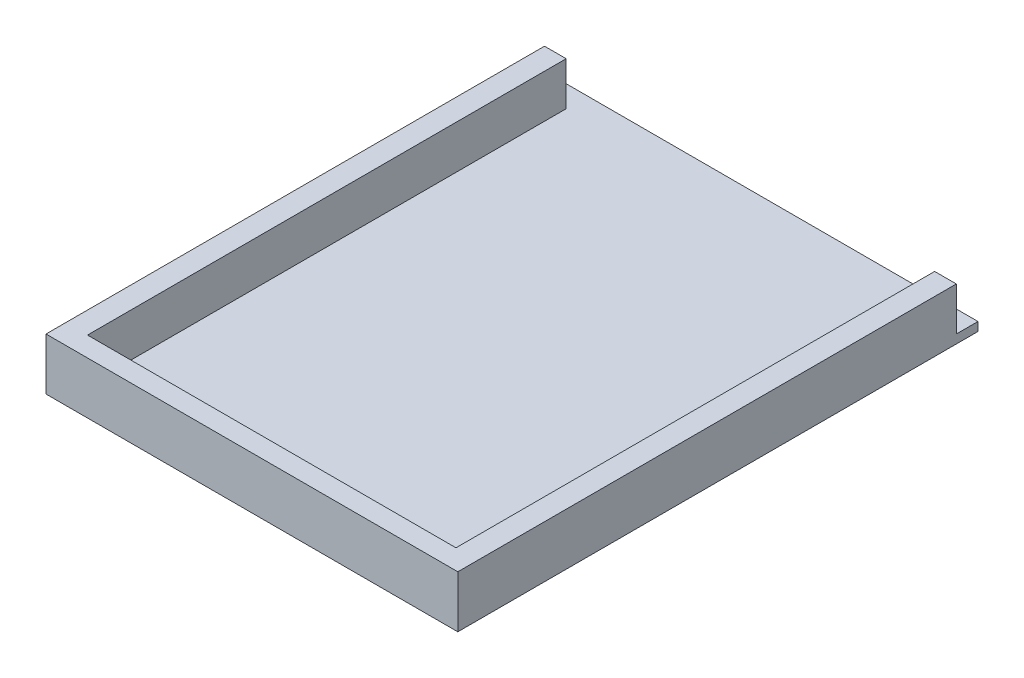
ISO-10303-21;
HEADER;
FILE_DESCRIPTION(('STEP AP214'),'2;1');
FILE_NAME('part.step','',(''),(''),'','','');
FILE_SCHEMA(('AUTOMOTIVE_DESIGN { 1 0 10303 214 1 1 1 1 }'));
ENDSEC;
DATA;
#1=APPLICATION_CONTEXT('core data for automotive mechanical design processes');
#2=APPLICATION_PROTOCOL_DEFINITION('international standard','automotive_design',2000,#1);
#3=PRODUCT_CONTEXT('',#1,'mechanical');
#4=PRODUCT('Part','Part','',(#3));
#5=PRODUCT_RELATED_PRODUCT_CATEGORY('part','',(#4));
#6=PRODUCT_DEFINITION_FORMATION('','',#4);
#7=PRODUCT_DEFINITION_CONTEXT('part definition',#1,'design');
#8=PRODUCT_DEFINITION('design','',#6,#7);
#9=PRODUCT_DEFINITION_SHAPE('','',#8);
#10=(LENGTH_UNIT() NAMED_UNIT(*) SI_UNIT(.MILLI.,.METRE.));
#11=(NAMED_UNIT(*) PLANE_ANGLE_UNIT() SI_UNIT($,.RADIAN.));
#12=(NAMED_UNIT(*) SI_UNIT($,.STERADIAN.) SOLID_ANGLE_UNIT());
#13=UNCERTAINTY_MEASURE_WITH_UNIT(LENGTH_MEASURE(1.E-05),#10,'distance_accuracy_value','');
#14=(GEOMETRIC_REPRESENTATION_CONTEXT(3) GLOBAL_UNCERTAINTY_ASSIGNED_CONTEXT((#13)) GLOBAL_UNIT_ASSIGNED_CONTEXT((#10,
#11,#12)) REPRESENTATION_CONTEXT('',''));
#15=CARTESIAN_POINT('',(0.,0.,0.));
#16=DIRECTION('',(0.,0.,1.));
#17=DIRECTION('',(1.,0.,0.));
#18=AXIS2_PLACEMENT_3D('',#15,#16,#17);
#19=CARTESIAN_POINT('',(0.,5.08,0.));
#20=DIRECTION('',(0.,1.,0.));
#21=DIRECTION('',(0.,0.,1.));
#22=AXIS2_PLACEMENT_3D('',#19,#20,#21);
#23=PLANE('',#22);
#24=DIRECTION('',(0.,0.,-1.));
#25=VECTOR('',#24,1.);
#26=CARTESIAN_POINT('',(107.95,5.08,0.));
#27=LINE('',#26,#25);
#28=CARTESIAN_POINT('',(107.95,5.08,140.783695346635));
#29=VERTEX_POINT('',#28);
#30=CARTESIAN_POINT('',(107.95,5.08,-139.7));
#31=VERTEX_POINT('',#30);
#32=EDGE_CURVE('E53',#29,#31,#27,.T.);
#33=ORIENTED_EDGE('',*,*,#32,.T.);
#34=DIRECTION('',(1.,0.,0.));
#35=VECTOR('',#34,1.);
#36=CARTESIAN_POINT('',(0.,5.08,-139.7));
#37=LINE('',#36,#35);
#38=CARTESIAN_POINT('',(120.65,5.08,-139.7));
#39=VERTEX_POINT('',#38);
#40=EDGE_CURVE('E39',#31,#39,#37,.T.);
#41=ORIENTED_EDGE('',*,*,#40,.T.);
#42=DIRECTION('',(0.,0.,-1.));
#43=VECTOR('',#42,1.);
#44=CARTESIAN_POINT('',(120.65,5.08,0.));
#45=LINE('',#44,#43);
#46=CARTESIAN_POINT('',(120.65,5.08,-152.4));
#47=VERTEX_POINT('',#46);
#48=EDGE_CURVE('E105',#39,#47,#45,.T.);
#49=ORIENTED_EDGE('',*,*,#48,.T.);
#50=DIRECTION('',(1.,0.,0.));
#51=VECTOR('',#50,1.);
#52=CARTESIAN_POINT('',(0.,5.08,-152.4));
#53=LINE('',#52,#51);
#54=CARTESIAN_POINT('',(-120.65,5.08,-152.4));
#55=VERTEX_POINT('',#54);
#56=EDGE_CURVE('E108',#55,#47,#53,.T.);
#57=ORIENTED_EDGE('',*,*,#56,.F.);
#58=DIRECTION('',(0.,0.,-1.));
#59=VECTOR('',#58,1.);
#60=CARTESIAN_POINT('',(-120.65,5.08,0.));
#61=LINE('',#60,#59);
#62=CARTESIAN_POINT('',(-120.65,5.08,-139.7));
#63=VERTEX_POINT('',#62);
#64=EDGE_CURVE('E62',#63,#55,#61,.T.);
#65=ORIENTED_EDGE('',*,*,#64,.F.);
#66=CARTESIAN_POINT('',(-107.95,5.08,-139.7));
#67=VERTEX_POINT('',#66);
#68=EDGE_CURVE('E207',#63,#67,#37,.T.);
#69=ORIENTED_EDGE('',*,*,#68,.T.);
#70=DIRECTION('',(0.,0.,1.));
#71=VECTOR('',#70,1.);
#72=CARTESIAN_POINT('',(-107.95,5.08,0.));
#73=LINE('',#72,#71);
#74=CARTESIAN_POINT('',(-107.95,5.08,140.783695346635));
#75=VERTEX_POINT('',#74);
#76=EDGE_CURVE('E205',#67,#75,#73,.T.);
#77=ORIENTED_EDGE('',*,*,#76,.T.);
#78=DIRECTION('',(1.,0.,0.));
#79=VECTOR('',#78,1.);
#80=CARTESIAN_POINT('',(0.,5.08,140.783695346635));
#81=LINE('',#80,#79);
#82=EDGE_CURVE('E203',#75,#29,#81,.T.);
#83=ORIENTED_EDGE('',*,*,#82,.T.);
#84=EDGE_LOOP('',(#33,#41,#49,#57,#65,#69,#77,#83));
#85=FACE_BOUND('',#84,.T.);
#86=ADVANCED_FACE('F35',(#85),#23,.T.);
#87=CARTESIAN_POINT('',(0.,5.08,152.4));
#88=DIRECTION('',(0.,0.,-1.));
#89=DIRECTION('',(-1.,0.,0.));
#90=AXIS2_PLACEMENT_3D('',#87,#88,#89);
#91=PLANE('',#90);
#92=DIRECTION('',(1.,0.,0.));
#93=VECTOR('',#92,1.);
#94=CARTESIAN_POINT('',(0.,0.,152.4));
#95=LINE('',#94,#93);
#96=CARTESIAN_POINT('',(-120.65,0.,152.4));
#97=VERTEX_POINT('',#96);
#98=CARTESIAN_POINT('',(120.65,0.,152.4));
#99=VERTEX_POINT('',#98);
#100=EDGE_CURVE('E85',#97,#99,#95,.T.);
#101=ORIENTED_EDGE('',*,*,#100,.T.);
#102=DIRECTION('',(0.,-1.,0.));
#103=VECTOR('',#102,1.);
#104=CARTESIAN_POINT('',(120.65,5.08,152.4));
#105=LINE('',#104,#103);
#106=CARTESIAN_POINT('',(120.65,30.48,152.4));
#107=VERTEX_POINT('',#106);
#108=EDGE_CURVE('E11',#107,#99,#105,.T.);
#109=ORIENTED_EDGE('',*,*,#108,.F.);
#110=DIRECTION('',(1.,0.,0.));
#111=VECTOR('',#110,1.);
#112=CARTESIAN_POINT('',(0.,30.48,152.4));
#113=LINE('',#112,#111);
#114=CARTESIAN_POINT('',(-120.65,30.48,152.4));
#115=VERTEX_POINT('',#114);
#116=EDGE_CURVE('E88',#115,#107,#113,.T.);
#117=ORIENTED_EDGE('',*,*,#116,.F.);
#118=DIRECTION('',(0.,-1.,0.));
#119=VECTOR('',#118,1.);
#120=CARTESIAN_POINT('',(-120.65,5.08,152.4));
#121=LINE('',#120,#119);
#122=EDGE_CURVE('E82',#115,#97,#121,.T.);
#123=ORIENTED_EDGE('',*,*,#122,.T.);
#124=EDGE_LOOP('',(#101,#109,#117,#123));
#125=FACE_BOUND('',#124,.T.);
#126=ADVANCED_FACE('F37',(#125),#91,.F.);
#127=CARTESIAN_POINT('',(120.65,5.08,0.));
#128=DIRECTION('',(-1.,0.,0.));
#129=DIRECTION('',(0.,0.,1.));
#130=AXIS2_PLACEMENT_3D('',#127,#128,#129);
#131=PLANE('',#130);
#132=DIRECTION('',(0.,0.,-1.));
#133=VECTOR('',#132,1.);
#134=CARTESIAN_POINT('',(120.65,0.,0.));
#135=LINE('',#134,#133);
#136=CARTESIAN_POINT('',(120.65,0.,-152.4));
#137=VERTEX_POINT('',#136);
#138=EDGE_CURVE('E100',#99,#137,#135,.T.);
#139=ORIENTED_EDGE('',*,*,#138,.T.);
#140=DIRECTION('',(0.,-1.,0.));
#141=VECTOR('',#140,1.);
#142=CARTESIAN_POINT('',(120.65,5.08,-152.4));
#143=LINE('',#142,#141);
#144=EDGE_CURVE('E45',#47,#137,#143,.T.);
#145=ORIENTED_EDGE('',*,*,#144,.F.);
#146=ORIENTED_EDGE('',*,*,#48,.F.);
#147=DIRECTION('',(0.,-1.,0.));
#148=VECTOR('',#147,1.);
#149=CARTESIAN_POINT('',(120.65,30.48,-139.7));
#150=LINE('',#149,#148);
#151=CARTESIAN_POINT('',(120.65,30.48,-139.7));
#152=VERTEX_POINT('',#151);
#153=EDGE_CURVE('E141',#152,#39,#150,.T.);
#154=ORIENTED_EDGE('',*,*,#153,.F.);
#155=DIRECTION('',(0.,0.,-1.));
#156=VECTOR('',#155,1.);
#157=CARTESIAN_POINT('',(120.65,30.48,0.));
#158=LINE('',#157,#156);
#159=EDGE_CURVE('E200',#107,#152,#158,.T.);
#160=ORIENTED_EDGE('',*,*,#159,.F.);
#161=ORIENTED_EDGE('',*,*,#108,.T.);
#162=EDGE_LOOP('',(#139,#145,#146,#154,#160,#161));
#163=FACE_BOUND('',#162,.T.);
#164=ADVANCED_FACE('F126',(#163),#131,.F.);
#165=CARTESIAN_POINT('',(0.,5.08,-152.4));
#166=DIRECTION('',(0.,0.,-1.));
#167=DIRECTION('',(-1.,0.,0.));
#168=AXIS2_PLACEMENT_3D('',#165,#166,#167);
#169=PLANE('',#168);
#170=DIRECTION('',(1.,0.,0.));
#171=VECTOR('',#170,1.);
#172=CARTESIAN_POINT('',(0.,0.,-152.4));
#173=LINE('',#172,#171);
#174=CARTESIAN_POINT('',(-120.65,0.,-152.4));
#175=VERTEX_POINT('',#174);
#176=EDGE_CURVE('E106',#175,#137,#173,.T.);
#177=ORIENTED_EDGE('',*,*,#176,.F.);
#178=DIRECTION('',(0.,-1.,0.));
#179=VECTOR('',#178,1.);
#180=CARTESIAN_POINT('',(-120.65,5.08,-152.4));
#181=LINE('',#180,#179);
#182=EDGE_CURVE('E92',#55,#175,#181,.T.);
#183=ORIENTED_EDGE('',*,*,#182,.F.);
#184=ORIENTED_EDGE('',*,*,#56,.T.);
#185=ORIENTED_EDGE('',*,*,#144,.T.);
#186=EDGE_LOOP('',(#177,#183,#184,#185));
#187=FACE_BOUND('',#186,.T.);
#188=ADVANCED_FACE('F130',(#187),#169,.T.);
#189=CARTESIAN_POINT('',(-120.65,5.08,0.));
#190=DIRECTION('',(-1.,0.,0.));
#191=DIRECTION('',(0.,0.,1.));
#192=AXIS2_PLACEMENT_3D('',#189,#190,#191);
#193=PLANE('',#192);
#194=DIRECTION('',(0.,0.,-1.));
#195=VECTOR('',#194,1.);
#196=CARTESIAN_POINT('',(-120.65,0.,0.));
#197=LINE('',#196,#195);
#198=EDGE_CURVE('E98',#97,#175,#197,.T.);
#199=ORIENTED_EDGE('',*,*,#198,.F.);
#200=ORIENTED_EDGE('',*,*,#122,.F.);
#201=DIRECTION('',(0.,0.,1.));
#202=VECTOR('',#201,1.);
#203=CARTESIAN_POINT('',(-120.65,30.48,0.));
#204=LINE('',#203,#202);
#205=CARTESIAN_POINT('',(-120.65,30.48,-139.7));
#206=VERTEX_POINT('',#205);
#207=EDGE_CURVE('E197',#206,#115,#204,.T.);
#208=ORIENTED_EDGE('',*,*,#207,.F.);
#209=DIRECTION('',(0.,-1.,0.));
#210=VECTOR('',#209,1.);
#211=CARTESIAN_POINT('',(-120.65,30.48,-139.7));
#212=LINE('',#211,#210);
#213=EDGE_CURVE('E217',#206,#63,#212,.T.);
#214=ORIENTED_EDGE('',*,*,#213,.T.);
#215=ORIENTED_EDGE('',*,*,#64,.T.);
#216=ORIENTED_EDGE('',*,*,#182,.T.);
#217=EDGE_LOOP('',(#199,#200,#208,#214,#215,#216));
#218=FACE_BOUND('',#217,.T.);
#219=ADVANCED_FACE('F103',(#218),#193,.T.);
#220=CARTESIAN_POINT('',(0.,0.,0.));
#221=DIRECTION('',(0.,1.,0.));
#222=DIRECTION('',(0.,0.,1.));
#223=AXIS2_PLACEMENT_3D('',#220,#221,#222);
#224=PLANE('',#223);
#225=ORIENTED_EDGE('',*,*,#100,.F.);
#226=ORIENTED_EDGE('',*,*,#198,.T.);
#227=ORIENTED_EDGE('',*,*,#176,.T.);
#228=ORIENTED_EDGE('',*,*,#138,.F.);
#229=EDGE_LOOP('',(#225,#226,#227,#228));
#230=FACE_BOUND('',#229,.T.);
#231=ADVANCED_FACE('F96',(#230),#224,.F.);
#232=CARTESIAN_POINT('',(107.95,30.48,0.));
#233=DIRECTION('',(-1.,0.,0.));
#234=DIRECTION('',(0.,0.,1.));
#235=AXIS2_PLACEMENT_3D('',#232,#233,#234);
#236=PLANE('',#235);
#237=ORIENTED_EDGE('',*,*,#32,.F.);
#238=DIRECTION('',(0.,-1.,0.));
#239=VECTOR('',#238,1.);
#240=CARTESIAN_POINT('',(107.95,30.48,140.783695346635));
#241=LINE('',#240,#239);
#242=CARTESIAN_POINT('',(107.95,30.48,140.783695346635));
#243=VERTEX_POINT('',#242);
#244=EDGE_CURVE('E101',#243,#29,#241,.T.);
#245=ORIENTED_EDGE('',*,*,#244,.F.);
#246=DIRECTION('',(0.,0.,-1.));
#247=VECTOR('',#246,1.);
#248=CARTESIAN_POINT('',(107.95,30.48,0.));
#249=LINE('',#248,#247);
#250=CARTESIAN_POINT('',(107.95,30.48,-139.7));
#251=VERTEX_POINT('',#250);
#252=EDGE_CURVE('E174',#243,#251,#249,.T.);
#253=ORIENTED_EDGE('',*,*,#252,.T.);
#254=DIRECTION('',(0.,-1.,0.));
#255=VECTOR('',#254,1.);
#256=CARTESIAN_POINT('',(107.95,30.48,-139.7));
#257=LINE('',#256,#255);
#258=EDGE_CURVE('E210',#251,#31,#257,.T.);
#259=ORIENTED_EDGE('',*,*,#258,.T.);
#260=EDGE_LOOP('',(#237,#245,#253,#259));
#261=FACE_BOUND('',#260,.T.);
#262=ADVANCED_FACE('F173',(#261),#236,.T.);
#263=CARTESIAN_POINT('',(0.,30.48,140.783695346635));
#264=DIRECTION('',(0.,0.,-1.));
#265=DIRECTION('',(-1.,0.,0.));
#266=AXIS2_PLACEMENT_3D('',#263,#264,#265);
#267=PLANE('',#266);
#268=ORIENTED_EDGE('',*,*,#82,.F.);
#269=DIRECTION('',(0.,-1.,0.));
#270=VECTOR('',#269,1.);
#271=CARTESIAN_POINT('',(-107.95,30.48,140.783695346635));
#272=LINE('',#271,#270);
#273=CARTESIAN_POINT('',(-107.95,30.48,140.783695346635));
#274=VERTEX_POINT('',#273);
#275=EDGE_CURVE('E180',#274,#75,#272,.T.);
#276=ORIENTED_EDGE('',*,*,#275,.F.);
#277=DIRECTION('',(1.,0.,0.));
#278=VECTOR('',#277,1.);
#279=CARTESIAN_POINT('',(0.,30.48,140.783695346635));
#280=LINE('',#279,#278);
#281=EDGE_CURVE('E185',#274,#243,#280,.T.);
#282=ORIENTED_EDGE('',*,*,#281,.T.);
#283=ORIENTED_EDGE('',*,*,#244,.T.);
#284=EDGE_LOOP('',(#268,#276,#282,#283));
#285=FACE_BOUND('',#284,.T.);
#286=ADVANCED_FACE('F189',(#285),#267,.T.);
#287=CARTESIAN_POINT('',(-107.95,30.48,0.));
#288=DIRECTION('',(1.,0.,0.));
#289=DIRECTION('',(0.,0.,-1.));
#290=AXIS2_PLACEMENT_3D('',#287,#288,#289);
#291=PLANE('',#290);
#292=ORIENTED_EDGE('',*,*,#76,.F.);
#293=DIRECTION('',(0.,-1.,0.));
#294=VECTOR('',#293,1.);
#295=CARTESIAN_POINT('',(-107.95,30.48,-139.7));
#296=LINE('',#295,#294);
#297=CARTESIAN_POINT('',(-107.95,30.48,-139.7));
#298=VERTEX_POINT('',#297);
#299=EDGE_CURVE('E219',#298,#67,#296,.T.);
#300=ORIENTED_EDGE('',*,*,#299,.F.);
#301=DIRECTION('',(0.,0.,1.));
#302=VECTOR('',#301,1.);
#303=CARTESIAN_POINT('',(-107.95,30.48,0.));
#304=LINE('',#303,#302);
#305=EDGE_CURVE('E190',#298,#274,#304,.T.);
#306=ORIENTED_EDGE('',*,*,#305,.T.);
#307=ORIENTED_EDGE('',*,*,#275,.T.);
#308=EDGE_LOOP('',(#292,#300,#306,#307));
#309=FACE_BOUND('',#308,.T.);
#310=ADVANCED_FACE('F224',(#309),#291,.T.);
#311=CARTESIAN_POINT('',(0.,30.48,-139.7));
#312=DIRECTION('',(0.,0.,-1.));
#313=DIRECTION('',(-1.,0.,0.));
#314=AXIS2_PLACEMENT_3D('',#311,#312,#313);
#315=PLANE('',#314);
#316=ORIENTED_EDGE('',*,*,#68,.F.);
#317=ORIENTED_EDGE('',*,*,#213,.F.);
#318=DIRECTION('',(1.,0.,0.));
#319=VECTOR('',#318,1.);
#320=CARTESIAN_POINT('',(0.,30.48,-139.7));
#321=LINE('',#320,#319);
#322=EDGE_CURVE('E192',#206,#298,#321,.T.);
#323=ORIENTED_EDGE('',*,*,#322,.T.);
#324=ORIENTED_EDGE('',*,*,#299,.T.);
#325=EDGE_LOOP('',(#316,#317,#323,#324));
#326=FACE_BOUND('',#325,.T.);
#327=ADVANCED_FACE('F226',(#326),#315,.T.);
#328=ORIENTED_EDGE('',*,*,#40,.F.);
#329=ORIENTED_EDGE('',*,*,#258,.F.);
#330=EDGE_CURVE('E187',#251,#152,#321,.T.);
#331=ORIENTED_EDGE('',*,*,#330,.T.);
#332=ORIENTED_EDGE('',*,*,#153,.T.);
#333=EDGE_LOOP('',(#328,#329,#331,#332));
#334=FACE_BOUND('',#333,.T.);
#335=ADVANCED_FACE('F220',(#334),#315,.T.);
#336=CARTESIAN_POINT('',(0.,30.48,0.));
#337=DIRECTION('',(0.,1.,0.));
#338=DIRECTION('',(0.,0.,1.));
#339=AXIS2_PLACEMENT_3D('',#336,#337,#338);
#340=PLANE('',#339);
#341=ORIENTED_EDGE('',*,*,#252,.F.);
#342=ORIENTED_EDGE('',*,*,#281,.F.);
#343=ORIENTED_EDGE('',*,*,#305,.F.);
#344=ORIENTED_EDGE('',*,*,#322,.F.);
#345=ORIENTED_EDGE('',*,*,#207,.T.);
#346=ORIENTED_EDGE('',*,*,#116,.T.);
#347=ORIENTED_EDGE('',*,*,#159,.T.);
#348=ORIENTED_EDGE('',*,*,#330,.F.);
#349=EDGE_LOOP('',(#341,#342,#343,#344,#345,#346,#347,#348));
#350=FACE_BOUND('',#349,.T.);
#351=ADVANCED_FACE('F183',(#350),#340,.T.);
#352=CLOSED_SHELL('',(#86,#126,#164,#188,#219,#231,#262,#286,#310,#327,#335,#351));
#353=MANIFOLD_SOLID_BREP('B2',#352);
#354=ADVANCED_BREP_SHAPE_REPRESENTATION('',(#18,#353),#14);
#355=SHAPE_DEFINITION_REPRESENTATION(#9,#354);
ENDSEC;
END-ISO-10303-21;
